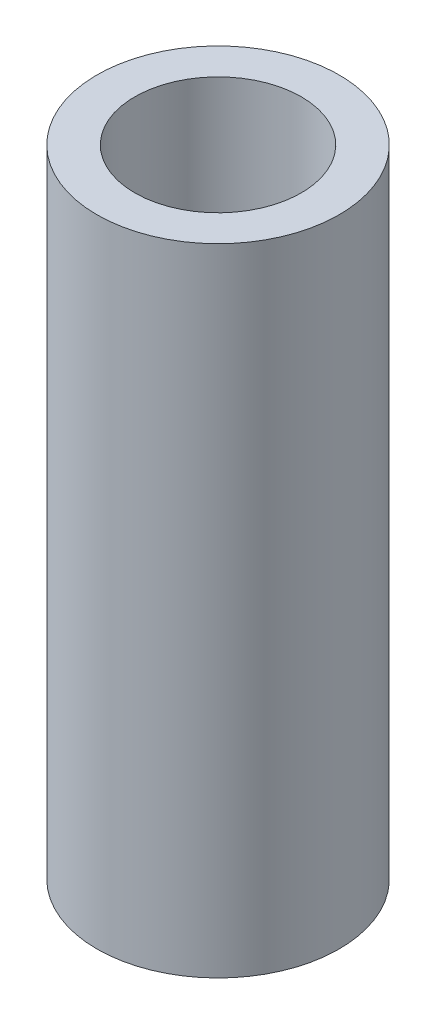
ISO-10303-21;
HEADER;
FILE_DESCRIPTION(('STEP AP214'),'2;1');
FILE_NAME('part.step','',(''),(''),'','','');
FILE_SCHEMA(('AUTOMOTIVE_DESIGN { 1 0 10303 214 1 1 1 1 }'));
ENDSEC;
DATA;
#1=APPLICATION_CONTEXT('core data for automotive mechanical design processes');
#2=APPLICATION_PROTOCOL_DEFINITION('international standard','automotive_design',2000,#1);
#3=PRODUCT_CONTEXT('',#1,'mechanical');
#4=PRODUCT('Part','Part','',(#3));
#5=PRODUCT_RELATED_PRODUCT_CATEGORY('part','',(#4));
#6=PRODUCT_DEFINITION_FORMATION('','',#4);
#7=PRODUCT_DEFINITION_CONTEXT('part definition',#1,'design');
#8=PRODUCT_DEFINITION('design','',#6,#7);
#9=PRODUCT_DEFINITION_SHAPE('','',#8);
#10=(LENGTH_UNIT() NAMED_UNIT(*) SI_UNIT(.MILLI.,.METRE.));
#11=(NAMED_UNIT(*) PLANE_ANGLE_UNIT() SI_UNIT($,.RADIAN.));
#12=(NAMED_UNIT(*) SI_UNIT($,.STERADIAN.) SOLID_ANGLE_UNIT());
#13=UNCERTAINTY_MEASURE_WITH_UNIT(LENGTH_MEASURE(1.E-05),#10,'distance_accuracy_value','');
#14=(GEOMETRIC_REPRESENTATION_CONTEXT(3) GLOBAL_UNCERTAINTY_ASSIGNED_CONTEXT((#13)) GLOBAL_UNIT_ASSIGNED_CONTEXT((#10,
#11,#12)) REPRESENTATION_CONTEXT('',''));
#15=CARTESIAN_POINT('',(0.,0.,0.));
#16=DIRECTION('',(0.,0.,1.));
#17=DIRECTION('',(1.,0.,0.));
#18=AXIS2_PLACEMENT_3D('',#15,#16,#17);
#19=CARTESIAN_POINT('',(0.,21.,0.));
#20=DIRECTION('',(0.,-1.,0.));
#21=DIRECTION('',(0.,0.,-1.));
#22=AXIS2_PLACEMENT_3D('',#19,#20,#21);
#23=CYLINDRICAL_SURFACE('',#22,4.);
#24=DIRECTION('',(0.,-1.,0.));
#25=VECTOR('',#24,1.);
#26=CARTESIAN_POINT('',(-3.99991645107305,21.,-0.0258531320189111));
#27=LINE('',#26,#25);
#28=CARTESIAN_POINT('',(-3.99991645107308,17.399761270919,-0.025853132018911));
#29=VERTEX_POINT('',#28);
#30=CARTESIAN_POINT('',(-3.99991645107308,14.600238729081,-0.025853132018911));
#31=VERTEX_POINT('',#30);
#32=EDGE_CURVE('E11',#29,#31,#27,.T.);
#33=ORIENTED_EDGE('',*,*,#32,.T.);
#34=CARTESIAN_POINT('',(-3.99991645107308,14.600238729081,-0.0258531320190421));
#35=CARTESIAN_POINT('',(-3.99967225830139,14.6009439988238,-0.0640921575293315));
#36=CARTESIAN_POINT('',(-3.99887347610365,14.6032187619792,-0.102278964228953));
#37=CARTESIAN_POINT('',(-3.99620499133585,14.6108738995903,-0.178292419562263));
#38=CARTESIAN_POINT('',(-3.99433556857381,14.6162534626206,-0.216119159673172));
#39=CARTESIAN_POINT('',(-3.98719610185074,14.6369488008378,-0.328422064505284));
#40=CARTESIAN_POINT('',(-3.98039240823535,14.6568271415164,-0.402013757078062));
#41=CARTESIAN_POINT('',(-3.96340813940453,14.7080320373958,-0.544576356502268));
#42=CARTESIAN_POINT('',(-3.95322930854667,14.7393526797706,-0.613549628185836));
#43=CARTESIAN_POINT('',(-3.93052020660311,14.8124834378182,-0.745307835813629));
#44=CARTESIAN_POINT('',(-3.91798857048058,14.8542996475161,-0.808089146927107));
#45=CARTESIAN_POINT('',(-3.89135352945277,14.9489240346771,-0.928050448785724));
#46=CARTESIAN_POINT('',(-3.8772106603566,15.0020634331421,-0.984960294435631));
#47=CARTESIAN_POINT('',(-3.84921378824501,15.1170764566808,-1.08925407411135));
#48=CARTESIAN_POINT('',(-3.83535986056662,15.1789523277724,-1.1366355509169));
#49=CARTESIAN_POINT('',(-3.80908699514521,15.3118854332206,-1.22184578759158));
#50=CARTESIAN_POINT('',(-3.79672101385227,15.3831561146456,-1.2593593716383));
#51=CARTESIAN_POINT('',(-3.77546131742445,15.5315120212514,-1.32173627746362));
#52=CARTESIAN_POINT('',(-3.76656616175619,15.6085948182841,-1.34660484873724));
#53=CARTESIAN_POINT('',(-3.75372261689463,15.7631109656046,-1.38199497149599));
#54=CARTESIAN_POINT('',(-3.74958979642407,15.840405738016,-1.39305292756278));
#55=CARTESIAN_POINT('',(-3.74619639341714,15.9958548095515,-1.40215536416123));
#56=CARTESIAN_POINT('',(-3.74693437342952,16.0740088482956,-1.40020368404321));
#57=CARTESIAN_POINT('',(-3.75302260858192,16.2249354068714,-1.38379454669174));
#58=CARTESIAN_POINT('',(-3.75814713768332,16.2977849538027,-1.36994900946075));
#59=CARTESIAN_POINT('',(-3.77208656020989,16.440062954669,-1.33108421220736));
#60=CARTESIAN_POINT('',(-3.78090196998585,16.5094909284095,-1.30606338874007));
#61=CARTESIAN_POINT('',(-3.8014547569224,16.6446909983725,-1.24498869082329));
#62=CARTESIAN_POINT('',(-3.81325163509311,16.7103504237503,-1.20870621983939));
#63=CARTESIAN_POINT('',(-3.83839332211351,16.8348584792766,-1.12631614578102));
#64=CARTESIAN_POINT('',(-3.85173858055954,16.8937051212682,-1.08020568572731));
#65=CARTESIAN_POINT('',(-3.87940616234065,17.0064550711861,-0.976347097309243));
#66=CARTESIAN_POINT('',(-3.89374063509772,17.0598814916565,-0.918083294265943));
#67=CARTESIAN_POINT('',(-3.92108981098457,17.156325832214,-0.79318088663264));
#68=CARTESIAN_POINT('',(-3.93410407430078,17.1993402902396,-0.726539507591292));
#69=CARTESIAN_POINT('',(-3.95748807810665,17.2739625280279,-0.586005200561402));
#70=CARTESIAN_POINT('',(-3.96783560070064,17.3054753314649,-0.51205802975848));
#71=CARTESIAN_POINT('',(-3.98454566226436,17.3554207033291,-0.359510885329969));
#72=CARTESIAN_POINT('',(-3.99091545014645,17.3738770736394,-0.280919662805801));
#73=CARTESIAN_POINT('',(-3.9963966045933,17.3896748938166,-0.172255891920458));
#74=CARTESIAN_POINT('',(-3.99754872485567,17.3929825667261,-0.143056897965824));
#75=CARTESIAN_POINT('',(-3.99921326658427,17.39775252398,-0.0845341011151192));
#76=CARTESIAN_POINT('',(-3.99972663497742,17.3992175400328,-0.0552105477894228));
#77=CARTESIAN_POINT('',(-3.99991645107305,17.399761270919,-0.0258531320190412));
#78=B_SPLINE_CURVE_WITH_KNOTS('',3,(#34,#35,#36,#37,#38,#39,#40,#41,#42,#43,#44,#45,#46,#47,#48,
#49,#50,#51,#52,#53,#54,#55,#56,#57,#58,#59,#60,#61,#62,#63,#64,#65,#66,#67,#68,#69,#70,#71,#72,
#73,#74,#75,#76,#77),.UNSPECIFIED.,.F.,.F.,(4,2,2,2,2,2,2,2,2,2,2,2,2,2,2,2,2,2,2,2,2,4),(0.,
0.114664507603254,0.229299061720669,0.457701131164789,0.685985340068443,0.9144024051538,
1.15074978367751,1.38715803462588,1.63038942015454,1.87351974714062,2.1068793264695,
2.34017004072909,2.56213147320374,2.78412396825833,3.01095516106762,3.23785238346189,
3.47775904339029,3.71774536497249,3.9596708177997,4.20115409590331,4.28932861164633,
4.37737225545862),.UNSPECIFIED.);
#79=EDGE_CURVE('E87',#31,#29,#78,.T.);
#80=ORIENTED_EDGE('',*,*,#79,.T.);
#81=EDGE_LOOP('',(#33,#80));
#82=FACE_BOUND('',#81,.T.);
#83=DIRECTION('',(0.,-1.,0.));
#84=VECTOR('',#83,1.);
#85=CARTESIAN_POINT('',(-3.99991645107305,21.,0.0258531320189111));
#86=LINE('',#85,#84);
#87=CARTESIAN_POINT('',(-3.99991645107308,14.600238729081,0.025853132018911));
#88=VERTEX_POINT('',#87);
#89=CARTESIAN_POINT('',(-3.99991645107308,17.399761270919,0.025853132018911));
#90=VERTEX_POINT('',#89);
#91=EDGE_CURVE('E48',#88,#90,#86,.F.);
#92=ORIENTED_EDGE('',*,*,#91,.T.);
#93=CARTESIAN_POINT('',(-3.99991645107308,17.399761270919,0.0258531320190421));
#94=CARTESIAN_POINT('',(-3.99967225830139,17.3990560011763,0.0640921575293312));
#95=CARTESIAN_POINT('',(-3.99887347610365,17.3967812380208,0.102278964228953));
#96=CARTESIAN_POINT('',(-3.99620499133585,17.3891261004098,0.178292419562263));
#97=CARTESIAN_POINT('',(-3.99433556857381,17.3837465373795,0.216119159673172));
#98=CARTESIAN_POINT('',(-3.98719610185074,17.3630511991623,0.328422064505283));
#99=CARTESIAN_POINT('',(-3.98039240823535,17.3431728584837,0.40201375707806));
#100=CARTESIAN_POINT('',(-3.96340813940453,17.2919679626042,0.544576356502268));
#101=CARTESIAN_POINT('',(-3.95322930854667,17.2606473202295,0.613549628185838));
#102=CARTESIAN_POINT('',(-3.93052020660311,17.1875165621819,0.74530783581363));
#103=CARTESIAN_POINT('',(-3.91798857048058,17.145700352484,0.808089146927105));
#104=CARTESIAN_POINT('',(-3.89135352945277,17.051075965323,0.928050448785722));
#105=CARTESIAN_POINT('',(-3.8772106603566,16.997936566858,0.98496029443563));
#106=CARTESIAN_POINT('',(-3.84921378824501,16.8829235433193,1.08925407411135));
#107=CARTESIAN_POINT('',(-3.83535986056663,16.8210476722277,1.13663555091689));
#108=CARTESIAN_POINT('',(-3.80908699514521,16.6881145667794,1.22184578759158));
#109=CARTESIAN_POINT('',(-3.79672101385227,16.6168438853544,1.25935937163829));
#110=CARTESIAN_POINT('',(-3.77546131742445,16.4684879787486,1.32173627746362));
#111=CARTESIAN_POINT('',(-3.76656616175619,16.391405181716,1.34660484873724));
#112=CARTESIAN_POINT('',(-3.75372261689463,16.2368890343955,1.38199497149599));
#113=CARTESIAN_POINT('',(-3.74958979642407,16.1595942619841,1.39305292756278));
#114=CARTESIAN_POINT('',(-3.74619639341714,16.0041451904485,1.40215536416123));
#115=CARTESIAN_POINT('',(-3.74693437342952,15.9259911517045,1.40020368404321));
#116=CARTESIAN_POINT('',(-3.75302260858192,15.7750645931286,1.38379454669174));
#117=CARTESIAN_POINT('',(-3.75814713768331,15.7022150461974,1.36994900946075));
#118=CARTESIAN_POINT('',(-3.77208656020989,15.5599370453311,1.33108421220736));
#119=CARTESIAN_POINT('',(-3.78090196998585,15.4905090715906,1.30606338874007));
#120=CARTESIAN_POINT('',(-3.8014547569224,15.3553090016275,1.24498869082329));
#121=CARTESIAN_POINT('',(-3.81325163509311,15.2896495762497,1.20870621983939));
#122=CARTESIAN_POINT('',(-3.83839332211351,15.1651415207234,1.12631614578102));
#123=CARTESIAN_POINT('',(-3.85173858055954,15.1062948787318,1.0802056857273));
#124=CARTESIAN_POINT('',(-3.87940616234065,14.993544928814,0.976347097309244));
#125=CARTESIAN_POINT('',(-3.89374063509773,14.9401185083435,0.918083294265944));
#126=CARTESIAN_POINT('',(-3.92108981098458,14.8436741677861,0.79318088663264));
#127=CARTESIAN_POINT('',(-3.93410407430078,14.8006597097605,0.726539507591293));
#128=CARTESIAN_POINT('',(-3.95748807810665,14.7260374719722,0.586005200561404));
#129=CARTESIAN_POINT('',(-3.96783560070064,14.6945246685351,0.512058029758483));
#130=CARTESIAN_POINT('',(-3.98454566226436,14.644579296671,0.359510885329972));
#131=CARTESIAN_POINT('',(-3.99091545014645,14.6261229263606,0.280919662805803));
#132=CARTESIAN_POINT('',(-3.9963966045933,14.6103251061834,0.17225589192046));
#133=CARTESIAN_POINT('',(-3.99754872485567,14.607017433274,0.143056897965826));
#134=CARTESIAN_POINT('',(-3.99921326658427,14.6022474760201,0.0845341011151206));
#135=CARTESIAN_POINT('',(-3.99972663497742,14.6007824599673,0.0552105477894235));
#136=CARTESIAN_POINT('',(-3.99991645107305,14.600238729081,0.0258531320190412));
#137=B_SPLINE_CURVE_WITH_KNOTS('',3,(#93,#94,#95,#96,#97,#98,#99,#100,#101,#102,#103,#104,#105,
#106,#107,#108,#109,#110,#111,#112,#113,#114,#115,#116,#117,#118,#119,#120,#121,#122,#123,#124,
#125,#126,#127,#128,#129,#130,#131,#132,#133,#134,#135,#136),.UNSPECIFIED.,.F.,.F.,(4,2,2,2,2,2,
2,2,2,2,2,2,2,2,2,2,2,2,2,2,2,4),(0.,0.114664507603254,0.229299061720668,0.457701131164788,
0.685985340068446,0.914402405153799,1.15074978367751,1.38715803462588,1.63038942015453,
1.87351974714062,2.1068793264695,2.34017004072909,2.56213147320374,2.78412396825833,
3.01095516106763,3.23785238346189,3.4777590433903,3.71774536497248,3.95967081779969,
4.20115409590331,4.28932861164633,4.37737225545862),.UNSPECIFIED.);
#138=EDGE_CURVE('E85',#90,#88,#137,.T.);
#139=ORIENTED_EDGE('',*,*,#138,.T.);
#140=EDGE_LOOP('',(#92,#139));
#141=FACE_BOUND('',#140,.T.);
#142=DIRECTION('',(0.,-1.,0.));
#143=VECTOR('',#142,1.);
#144=CARTESIAN_POINT('',(-3.99991645107305,21.,-0.0258531320189111));
#145=LINE('',#144,#143);
#146=CARTESIAN_POINT('',(-3.99991645107316,6.39976127091904,-0.025853132018911));
#147=VERTEX_POINT('',#146);
#148=CARTESIAN_POINT('',(-3.99991645107316,3.60023872908101,-0.025853132018911));
#149=VERTEX_POINT('',#148);
#150=EDGE_CURVE('E82',#147,#149,#145,.T.);
#151=ORIENTED_EDGE('',*,*,#150,.T.);
#152=CARTESIAN_POINT('',(-3.99991645107316,3.60023872908101,-0.0258531320189111));
#153=CARTESIAN_POINT('',(-3.99967225830142,3.60094399882377,-0.0640921575291983));
#154=CARTESIAN_POINT('',(-3.99887347610366,3.6032187619792,-0.102278964228819));
#155=CARTESIAN_POINT('',(-3.99620499133584,3.61087389959025,-0.178292419562128));
#156=CARTESIAN_POINT('',(-3.99433556857381,3.61625346262055,-0.216119159673037));
#157=CARTESIAN_POINT('',(-3.98719610185076,3.63694880083776,-0.328422064505149));
#158=CARTESIAN_POINT('',(-3.98039240823537,3.65682714151634,-0.402013757077929));
#159=CARTESIAN_POINT('',(-3.96340813940455,3.70803203739579,-0.544576356502139));
#160=CARTESIAN_POINT('',(-3.95322930854669,3.73935267977053,-0.61354962818571));
#161=CARTESIAN_POINT('',(-3.93052020660313,3.81248343781812,-0.745307835813509));
#162=CARTESIAN_POINT('',(-3.91798857048061,3.854299647516,-0.808089146926989));
#163=CARTESIAN_POINT('',(-3.8913535294528,3.94892403467695,-0.928050448785614));
#164=CARTESIAN_POINT('',(-3.87721066035663,4.00206343314195,-0.984960294435526));
#165=CARTESIAN_POINT('',(-3.84921378824504,4.11707645668067,-1.08925407411126));
#166=CARTESIAN_POINT('',(-3.83535986056665,4.17895232777225,-1.13663555091681));
#167=CARTESIAN_POINT('',(-3.80908699514523,4.31188543322051,-1.2218457875915));
#168=CARTESIAN_POINT('',(-3.79672101385229,4.38315611464547,-1.25935937163823));
#169=CARTESIAN_POINT('',(-3.77546131742447,4.53151202125127,-1.32173627746357));
#170=CARTESIAN_POINT('',(-3.76656616175621,4.60859481828395,-1.3466048487372));
#171=CARTESIAN_POINT('',(-3.75372261689464,4.76311096560443,-1.38199497149597));
#172=CARTESIAN_POINT('',(-3.74958979642408,4.84040573801585,-1.39305292756276));
#173=CARTESIAN_POINT('',(-3.74619639341714,4.99585480955136,-1.40215536416123));
#174=CARTESIAN_POINT('',(-3.74693437342952,5.07400884829543,-1.40020368404322));
#175=CARTESIAN_POINT('',(-3.75302260858191,5.22493540687129,-1.38379454669176));
#176=CARTESIAN_POINT('',(-3.7581471376833,5.29778495380255,-1.36994900946078));
#177=CARTESIAN_POINT('',(-3.77208656020987,5.44006295466883,-1.33108421220741));
#178=CARTESIAN_POINT('',(-3.78090196998583,5.50949092840937,-1.30606338874012));
#179=CARTESIAN_POINT('',(-3.80145475692238,5.6446909983724,-1.24498869082335));
#180=CARTESIAN_POINT('',(-3.81325163509309,5.71035042375019,-1.20870621983946));
#181=CARTESIAN_POINT('',(-3.83839332211348,5.83485847927652,-1.12631614578111));
#182=CARTESIAN_POINT('',(-3.85173858055951,5.8937051212681,-1.0802056857274));
#183=CARTESIAN_POINT('',(-3.87940616234062,6.00645507118598,-0.976347097309352));
#184=CARTESIAN_POINT('',(-3.8937406350977,6.05988149165643,-0.918083294266058));
#185=CARTESIAN_POINT('',(-3.92108981098455,6.15632583221387,-0.793180886632766));
#186=CARTESIAN_POINT('',(-3.93410407430075,6.19934029023948,-0.726539507591425));
#187=CARTESIAN_POINT('',(-3.95748807810663,6.27396252802781,-0.586005200561544));
#188=CARTESIAN_POINT('',(-3.96783560070062,6.30547533146489,-0.512058029758626));
#189=CARTESIAN_POINT('',(-3.98454566226434,6.35542070332904,-0.359510885330119));
#190=CARTESIAN_POINT('',(-3.99091545014644,6.37387707363939,-0.280919662805951));
#191=CARTESIAN_POINT('',(-3.9963966045933,6.3896748938166,-0.172255891920562));
#192=CARTESIAN_POINT('',(-3.99754872485567,6.3929825667261,-0.14305689796588));
#193=CARTESIAN_POINT('',(-3.99921326658427,6.39775252397999,-0.0845341011150808));
#194=CARTESIAN_POINT('',(-3.99972663497742,6.39921754003277,-0.0552105477893363));
#195=CARTESIAN_POINT('',(-3.99991645107305,6.39976127091905,-0.0258531320189066));
#196=B_SPLINE_CURVE_WITH_KNOTS('',3,(#152,#153,#154,#155,#156,#157,#158,#159,#160,#161,#162,
#163,#164,#165,#166,#167,#168,#169,#170,#171,#172,#173,#174,#175,#176,#177,#178,#179,#180,#181,
#182,#183,#184,#185,#186,#187,#188,#189,#190,#191,#192,#193,#194,#195),.UNSPECIFIED.,.F.,.F.,(4,
2,2,2,2,2,2,2,2,2,2,2,2,2,2,2,2,2,2,2,2,4),(0.,0.114664507603251,0.229299061720663,
0.457701131164782,0.685985340068434,0.914402405153786,1.15074978367749,1.38715803462586,
1.63038942015451,1.8735197471406,2.10687932646949,2.34017004072907,2.56213147320373,
2.78412396825832,3.01095516106761,3.23785238346187,3.47775904339027,3.71774536497246,
3.95967081779967,4.20115409590329,4.28932861164646,4.37737225545889),.UNSPECIFIED.);
#197=EDGE_CURVE('E177',#149,#147,#196,.T.);
#198=ORIENTED_EDGE('',*,*,#197,.T.);
#199=EDGE_LOOP('',(#151,#198));
#200=FACE_BOUND('',#199,.T.);
#201=DIRECTION('',(0.,-1.,0.));
#202=VECTOR('',#201,1.);
#203=CARTESIAN_POINT('',(-3.99991645107305,21.,0.0258531320189111));
#204=LINE('',#203,#202);
#205=CARTESIAN_POINT('',(-3.99991645107316,3.60023872908101,0.025853132018911));
#206=VERTEX_POINT('',#205);
#207=CARTESIAN_POINT('',(-3.99991645107316,6.39976127091904,0.025853132018911));
#208=VERTEX_POINT('',#207);
#209=EDGE_CURVE('E182',#206,#208,#204,.F.);
#210=ORIENTED_EDGE('',*,*,#209,.T.);
#211=CARTESIAN_POINT('',(-3.99991645107316,6.39976127091904,0.0258531320189111));
#212=CARTESIAN_POINT('',(-3.99967225830142,6.39905600117628,0.0640921575291982));
#213=CARTESIAN_POINT('',(-3.99887347610366,6.39678123802085,0.102278964228819));
#214=CARTESIAN_POINT('',(-3.99620499133584,6.38912610040981,0.178292419562127));
#215=CARTESIAN_POINT('',(-3.99433556857381,6.38374653737951,0.216119159673036));
#216=CARTESIAN_POINT('',(-3.98719610185076,6.3630511991623,0.328422064505149));
#217=CARTESIAN_POINT('',(-3.98039240823537,6.34317285848372,0.402013757077927));
#218=CARTESIAN_POINT('',(-3.96340813940455,6.29196796260427,0.544576356502137));
#219=CARTESIAN_POINT('',(-3.95322930854669,6.26064732022953,0.613549628185708));
#220=CARTESIAN_POINT('',(-3.93052020660313,6.18751656218193,0.745307835813506));
#221=CARTESIAN_POINT('',(-3.9179885704806,6.14570035248406,0.808089146926986));
#222=CARTESIAN_POINT('',(-3.8913535294528,6.0510759653231,0.928050448785611));
#223=CARTESIAN_POINT('',(-3.87721066035663,5.99793656685811,0.984960294435523));
#224=CARTESIAN_POINT('',(-3.84921378824504,5.88292354331939,1.08925407411126));
#225=CARTESIAN_POINT('',(-3.83535986056665,5.82104767222781,1.1366355509168));
#226=CARTESIAN_POINT('',(-3.80908699514524,5.68811456677954,1.2218457875915));
#227=CARTESIAN_POINT('',(-3.79672101385229,5.61684388535459,1.25935937163823));
#228=CARTESIAN_POINT('',(-3.77546131742447,5.46848797874879,1.32173627746357));
#229=CARTESIAN_POINT('',(-3.76656616175621,5.39140518171611,1.3466048487372));
#230=CARTESIAN_POINT('',(-3.75372261689464,5.23688903439562,1.38199497149597));
#231=CARTESIAN_POINT('',(-3.74958979642408,5.1595942619842,1.39305292756276));
#232=CARTESIAN_POINT('',(-3.74619639341714,5.00414519044869,1.40215536416123));
#233=CARTESIAN_POINT('',(-3.74693437342952,4.92599115170463,1.40020368404322));
#234=CARTESIAN_POINT('',(-3.75302260858191,4.77506459312876,1.38379454669176));
#235=CARTESIAN_POINT('',(-3.7581471376833,4.70221504619751,1.36994900946078));
#236=CARTESIAN_POINT('',(-3.77208656020987,4.55993704533122,1.33108421220741));
#237=CARTESIAN_POINT('',(-3.78090196998583,4.49050907159068,1.30606338874012));
#238=CARTESIAN_POINT('',(-3.80145475692238,4.35530900162765,1.24498869082335));
#239=CARTESIAN_POINT('',(-3.81325163509309,4.28964957624987,1.20870621983946));
#240=CARTESIAN_POINT('',(-3.83839332211348,4.16514152072353,1.12631614578111));
#241=CARTESIAN_POINT('',(-3.85173858055951,4.10629487873195,1.0802056857274));
#242=CARTESIAN_POINT('',(-3.87940616234062,3.99354492881407,0.976347097309353));
#243=CARTESIAN_POINT('',(-3.8937406350977,3.94011850834362,0.918083294266059));
#244=CARTESIAN_POINT('',(-3.92108981098455,3.84367416778618,0.793180886632768));
#245=CARTESIAN_POINT('',(-3.93410407430075,3.80065970976057,0.726539507591427));
#246=CARTESIAN_POINT('',(-3.95748807810663,3.72603747197224,0.586005200561547));
#247=CARTESIAN_POINT('',(-3.96783560070062,3.69452466853517,0.512058029758628));
#248=CARTESIAN_POINT('',(-3.98454566226434,3.64457929667102,0.359510885330122));
#249=CARTESIAN_POINT('',(-3.99091545014644,3.62612292636067,0.280919662805955));
#250=CARTESIAN_POINT('',(-3.9963966045933,3.61032510618346,0.172255891920565));
#251=CARTESIAN_POINT('',(-3.99754872485567,3.60701743327396,0.143056897965883));
#252=CARTESIAN_POINT('',(-3.99921326658427,3.60224747602007,0.0845341011150814));
#253=CARTESIAN_POINT('',(-3.99972663497742,3.60078245996728,0.0552105477893365));
#254=CARTESIAN_POINT('',(-3.99991645107305,3.60023872908101,0.0258531320189065));
#255=B_SPLINE_CURVE_WITH_KNOTS('',3,(#211,#212,#213,#214,#215,#216,#217,#218,#219,#220,#221,
#222,#223,#224,#225,#226,#227,#228,#229,#230,#231,#232,#233,#234,#235,#236,#237,#238,#239,#240,
#241,#242,#243,#244,#245,#246,#247,#248,#249,#250,#251,#252,#253,#254),.UNSPECIFIED.,.F.,.F.,(4,
2,2,2,2,2,2,2,2,2,2,2,2,2,2,2,2,2,2,2,2,4),(0.,0.114664507603251,0.229299061720663,
0.457701131164781,0.685985340068431,0.914402405153782,1.15074978367749,1.38715803462585,
1.63038942015451,1.8735197471406,2.10687932646949,2.34017004072907,2.56213147320373,
2.78412396825832,3.01095516106761,3.23785238346187,3.47775904339027,3.71774536497246,
3.95967081779967,4.20115409590329,4.28932861164646,4.37737225545889),.UNSPECIFIED.);
#256=EDGE_CURVE('E174',#208,#206,#255,.T.);
#257=ORIENTED_EDGE('',*,*,#256,.T.);
#258=EDGE_LOOP('',(#210,#257));
#259=FACE_BOUND('',#258,.T.);
#260=CARTESIAN_POINT('',(0.,21.,0.));
#261=DIRECTION('',(0.,1.,0.));
#262=DIRECTION('',(0.,0.,1.));
#263=AXIS2_PLACEMENT_3D('',#260,#261,#262);
#264=CIRCLE('',#263,4.);
#265=CARTESIAN_POINT('',(0.,21.,4.));
#266=VERTEX_POINT('',#265);
#267=EDGE_CURVE('E222',#266,#266,#264,.T.);
#268=ORIENTED_EDGE('',*,*,#267,.F.);
#269=EDGE_LOOP('',(#268));
#270=FACE_BOUND('',#269,.T.);
#271=CARTESIAN_POINT('',(0.,0.,0.));
#272=DIRECTION('',(0.,1.,0.));
#273=DIRECTION('',(0.,0.,1.));
#274=AXIS2_PLACEMENT_3D('',#271,#272,#273);
#275=CIRCLE('',#274,4.);
#276=CARTESIAN_POINT('',(0.,0.,4.));
#277=VERTEX_POINT('',#276);
#278=EDGE_CURVE('E128',#277,#277,#275,.T.);
#279=ORIENTED_EDGE('',*,*,#278,.T.);
#280=EDGE_LOOP('',(#279));
#281=FACE_BOUND('',#280,.T.);
#282=ADVANCED_FACE('F39',(#82,#141,#200,#259,#270,#281),#23,.T.);
#283=CARTESIAN_POINT('',(0.,21.,0.));
#284=DIRECTION('',(0.,1.,0.));
#285=DIRECTION('',(0.,0.,1.));
#286=AXIS2_PLACEMENT_3D('',#283,#284,#285);
#287=PLANE('',#286);
#288=CARTESIAN_POINT('',(0.,21.,0.));
#289=DIRECTION('',(0.,1.,0.));
#290=DIRECTION('',(0.,0.,1.));
#291=AXIS2_PLACEMENT_3D('',#288,#289,#290);
#292=CIRCLE('',#291,2.75);
#293=CARTESIAN_POINT('',(0.,21.,2.75));
#294=VERTEX_POINT('',#293);
#295=EDGE_CURVE('E186',#294,#294,#292,.T.);
#296=ORIENTED_EDGE('',*,*,#295,.F.);
#297=EDGE_LOOP('',(#296));
#298=FACE_BOUND('',#297,.T.);
#299=ORIENTED_EDGE('',*,*,#267,.T.);
#300=EDGE_LOOP('',(#299));
#301=FACE_BOUND('',#300,.T.);
#302=ADVANCED_FACE('F151',(#298,#301),#287,.T.);
#303=CARTESIAN_POINT('',(0.,0.,0.));
#304=DIRECTION('',(0.,1.,0.));
#305=DIRECTION('',(0.,0.,1.));
#306=AXIS2_PLACEMENT_3D('',#303,#304,#305);
#307=PLANE('',#306);
#308=CARTESIAN_POINT('',(0.,0.,0.));
#309=DIRECTION('',(0.,-1.,0.));
#310=DIRECTION('',(0.,0.,-1.));
#311=AXIS2_PLACEMENT_3D('',#308,#309,#310);
#312=CIRCLE('',#311,3.2);
#313=CARTESIAN_POINT('',(0.,0.,-3.2));
#314=VERTEX_POINT('',#313);
#315=EDGE_CURVE('E213',#314,#314,#312,.T.);
#316=ORIENTED_EDGE('',*,*,#315,.F.);
#317=EDGE_LOOP('',(#316));
#318=FACE_BOUND('',#317,.T.);
#319=ORIENTED_EDGE('',*,*,#278,.F.);
#320=EDGE_LOOP('',(#319));
#321=FACE_BOUND('',#320,.T.);
#322=ADVANCED_FACE('F149',(#318,#321),#307,.F.);
#323=CARTESIAN_POINT('',(0.,10.,0.));
#324=DIRECTION('',(0.,-1.,0.));
#325=DIRECTION('',(0.,0.,-1.));
#326=AXIS2_PLACEMENT_3D('',#323,#324,#325);
#327=CYLINDRICAL_SURFACE('',#326,3.2);
#328=CARTESIAN_POINT('',(-3.2,3.60000000000002,0.));
#329=CARTESIAN_POINT('',(-3.19999323929896,3.60000882862046,0.0746682325298775));
#330=CARTESIAN_POINT('',(-3.19735695673799,3.60600835816502,0.149436290609146));
#331=CARTESIAN_POINT('',(-3.18706462250722,3.62978490809575,0.296838561834425));
#332=CARTESIAN_POINT('',(-3.17939623551487,3.64759087100718,0.369467071934258));
#333=CARTESIAN_POINT('',(-3.15985979638772,3.69418283092299,0.510210727685957));
#334=CARTESIAN_POINT('',(-3.14800655397558,3.72293013541371,0.57834079637958));
#335=CARTESIAN_POINT('',(-3.12123780515295,3.79042054568872,0.708739295318285));
#336=CARTESIAN_POINT('',(-3.10632305462494,3.82916118473621,0.7710091669143));
#337=CARTESIAN_POINT('',(-3.07400114777708,3.91774957634818,0.891399307299581));
#338=CARTESIAN_POINT('',(-3.05650709697098,3.96805267426737,0.949160930428645));
#339=CARTESIAN_POINT('',(-3.02135131890907,4.07737245601193,1.05574232998401));
#340=CARTESIAN_POINT('',(-3.00368950092187,4.13639413946651,1.10455693955992));
#341=CARTESIAN_POINT('',(-2.9690927777526,4.26543856539599,1.19454701616179));
#342=CARTESIAN_POINT('',(-2.95225267260003,4.33589015374362,1.23514788937881));
#343=CARTESIAN_POINT('',(-2.92260314752168,4.48346132572815,1.30376311363399));
#344=CARTESIAN_POINT('',(-2.9097914452503,4.56057710199087,1.3317845955581));
#345=CARTESIAN_POINT('',(-2.89059965408317,4.71516169742201,1.37292682646117));
#346=CARTESIAN_POINT('',(-2.88392212034105,4.79240748537646,1.38674110526249));
#347=CARTESIAN_POINT('',(-2.87691007594234,4.94838677799436,1.40123529298112));
#348=CARTESIAN_POINT('',(-2.87657152755454,5.02711930365459,1.40192356275211));
#349=CARTESIAN_POINT('',(-2.88202665013976,5.17658359891195,1.39066469697343));
#350=CARTESIAN_POINT('',(-2.88729445733953,5.24742021626037,1.37980117002711));
#351=CARTESIAN_POINT('',(-2.90247226483301,5.38614010882635,1.34757876598954));
#352=CARTESIAN_POINT('',(-2.91238326673219,5.45402274337172,1.32621762435952));
#353=CARTESIAN_POINT('',(-2.93595952759738,5.58670579267017,1.2731835971743));
#354=CARTESIAN_POINT('',(-2.94970322228104,5.65140437146944,1.24129238704281));
#355=CARTESIAN_POINT('',(-2.97938258432282,5.77479985933511,1.16825974889634));
#356=CARTESIAN_POINT('',(-2.99531916026687,5.83349426299944,1.12711448210096));
#357=CARTESIAN_POINT('',(-3.02940997516427,5.94902819970128,1.03220450369383));
#358=CARTESIAN_POINT('',(-3.04763179448214,6.00517368661696,0.977616720899959));
#359=CARTESIAN_POINT('',(-3.08298711786831,6.10775987826215,0.859639861912725));
#360=CARTESIAN_POINT('',(-3.10012031174763,6.15419782551534,0.796248293446521));
#361=CARTESIAN_POINT('',(-3.13196210037405,6.23721440381238,0.66016925228355));
#362=CARTESIAN_POINT('',(-3.14659001099467,6.2734829128974,0.587272278263271));
#363=CARTESIAN_POINT('',(-3.17114037284155,6.33299309785246,0.435607390856095));
#364=CARTESIAN_POINT('',(-3.18106569682268,6.35624272838524,0.356843095870493));
#365=CARTESIAN_POINT('',(-3.1945388332546,6.38753830009636,0.201455047470969));
#366=CARTESIAN_POINT('',(-3.19847581943999,6.39651393340044,0.125052333509547));
#367=CARTESIAN_POINT('',(-3.2007922664932,6.40181271555229,-0.0282640651341215));
#368=CARTESIAN_POINT('',(-3.19917353770823,6.39813998590759,-0.10517757521984));
#369=CARTESIAN_POINT('',(-3.19080873687224,6.37888616161881,-0.252793729037831));
#370=CARTESIAN_POINT('',(-3.18435437244214,6.36398229289883,-0.323603206184578));
#371=CARTESIAN_POINT('',(-3.1672925050764,6.3236594347154,-0.461624114121053));
#372=CARTESIAN_POINT('',(-3.15668449196048,6.29823915353068,-0.52883510176584));
#373=CARTESIAN_POINT('',(-3.13190520783963,6.23678768417317,-0.660132529349556));
#374=CARTESIAN_POINT('',(-3.11763295400634,6.20044975949184,-0.724055715670428));
#375=CARTESIAN_POINT('',(-3.08701554400474,6.11852910687444,-0.845127836893712));
#376=CARTESIAN_POINT('',(-3.07066949286605,6.07294238239581,-0.902273826296681));
#377=CARTESIAN_POINT('',(-3.03606354570034,5.96965439698898,-1.0128843281988));
#378=CARTESIAN_POINT('',(-3.01775402187564,5.91128397486417,-1.06571002168735));
#379=CARTESIAN_POINT('',(-2.98238476439398,5.78626291589081,-1.16102178855706));
#380=CARTESIAN_POINT('',(-2.96532543173475,5.71960964064346,-1.20350455451119));
#381=CARTESIAN_POINT('',(-2.93414786375579,5.57799844717799,-1.27766771000143));
#382=CARTESIAN_POINT('',(-2.92009882997794,5.50289565303897,-1.30910280610461));
#383=CARTESIAN_POINT('',(-2.89741141326388,5.34764857374586,-1.35858805747395));
#384=CARTESIAN_POINT('',(-2.88876794930699,5.26750910109906,-1.37665078517921));
#385=CARTESIAN_POINT('',(-2.87870059545969,5.11161889436916,-1.39757122414597));
#386=CARTESIAN_POINT('',(-2.87673758203622,5.03605511942191,-1.40156534379494));
#387=CARTESIAN_POINT('',(-2.87879673024831,4.88536230259502,-1.39733172107155));
#388=CARTESIAN_POINT('',(-2.8828177181642,4.81023317836314,-1.38910637546167));
#389=CARTESIAN_POINT('',(-2.89587822994622,4.66694548881129,-1.36165261619709));
#390=CARTESIAN_POINT('',(-2.90462124077084,4.59863295391721,-1.34307241616426));
#391=CARTESIAN_POINT('',(-2.92587878716624,4.46609672226217,-1.29610727139735));
#392=CARTESIAN_POINT('',(-2.93839440474458,4.40187420495353,-1.26771951345155));
#393=CARTESIAN_POINT('',(-2.96676558143144,4.2748988493906,-1.19988864897201));
#394=CARTESIAN_POINT('',(-2.98278224731329,4.21249548508154,-1.1598601773472));
#395=CARTESIAN_POINT('',(-3.0159494898889,4.09493768917059,-1.0706593907491));
#396=CARTESIAN_POINT('',(-3.03310051918632,4.03978617755641,-1.02148341162247));
#397=CARTESIAN_POINT('',(-3.06832603234553,3.93353609988187,-0.910514271123461));
#398=CARTESIAN_POINT('',(-3.08635772876448,3.88316263349807,-0.848009730462911));
#399=CARTESIAN_POINT('',(-3.11990113043651,3.79355326264327,-0.714792550563451));
#400=CARTESIAN_POINT('',(-3.13541168934315,3.75432241863165,-0.644076202378754));
#401=CARTESIAN_POINT('',(-3.16200691540381,3.68882772121614,-0.497203699003514));
#402=CARTESIAN_POINT('',(-3.17314582493306,3.66240392533636,-0.42112899753792));
#403=CARTESIAN_POINT('',(-3.18995281447474,3.6230014036058,-0.265147894197037));
#404=CARTESIAN_POINT('',(-3.19563769617754,3.60998137696073,-0.18525406117933));
#405=CARTESIAN_POINT('',(-3.19942859954671,3.60130795436467,-0.0699772697921454));
#406=CARTESIAN_POINT('',(-3.20000316897606,3.59999586171811,-0.0349996013486818));
#407=CARTESIAN_POINT('',(-3.2,3.60000000000002,0.));
#408=B_SPLINE_CURVE_WITH_KNOTS('',3,(#328,#329,#330,#331,#332,#333,#334,#335,#336,#337,#338,
#339,#340,#341,#342,#343,#344,#345,#346,#347,#348,#349,#350,#351,#352,#353,#354,#355,#356,#357,
#358,#359,#360,#361,#362,#363,#364,#365,#366,#367,#368,#369,#370,#371,#372,#373,#374,#375,#376,
#377,#378,#379,#380,#381,#382,#383,#384,#385,#386,#387,#388,#389,#390,#391,#392,#393,#394,#395,
#396,#397,#398,#399,#400,#401,#402,#403,#404,#405,#406,#407),.UNSPECIFIED.,.T.,.F.,(4,2,2,2,2,2,
2,2,2,2,2,2,2,2,2,2,2,2,2,2,2,2,2,2,2,2,2,2,2,2,2,2,2,2,2,2,2,2,2,4),(0.,0.22389784388117,
0.448346594706908,0.672008880095001,0.895616009826726,1.1303060725882,1.36513124343025,
1.61299389023415,1.86071585303957,2.09567060708281,2.33047569735744,2.54504901527542,
2.75966864114528,2.97905125230743,3.19852503646187,3.43864747577074,3.67883803068161,
3.92570866035185,4.17242828458789,4.4023023507457,4.63210151882834,4.84905357520543,
5.06603228751983,5.28979086692528,5.5136463424347,5.7550333097822,5.99649736596454,
6.24302657717685,6.48932371106909,6.7152018646058,6.94103571957449,7.15410460735167,
7.3672346628778,7.59383609576229,7.82052849302986,8.06618640407504,8.3119557037418,
8.55457109012829,8.7964366520339,8.90138537002498),.UNSPECIFIED.);
#409=CARTESIAN_POINT('',(-3.2,3.60000000000002,0.));
#410=VERTEX_POINT('',#409);
#411=EDGE_CURVE('E97',#410,#410,#408,.T.);
#412=ORIENTED_EDGE('',*,*,#411,.T.);
#413=EDGE_LOOP('',(#412));
#414=FACE_BOUND('',#413,.T.);
#415=CARTESIAN_POINT('',(0.,10.,0.));
#416=DIRECTION('',(0.,-1.,0.));
#417=DIRECTION('',(0.,0.,-1.));
#418=AXIS2_PLACEMENT_3D('',#415,#416,#417);
#419=CIRCLE('',#418,3.2);
#420=CARTESIAN_POINT('',(0.,10.,-3.2));
#421=VERTEX_POINT('',#420);
#422=EDGE_CURVE('E211',#421,#421,#419,.T.);
#423=ORIENTED_EDGE('',*,*,#422,.F.);
#424=EDGE_LOOP('',(#423));
#425=FACE_BOUND('',#424,.T.);
#426=ORIENTED_EDGE('',*,*,#315,.T.);
#427=EDGE_LOOP('',(#426));
#428=FACE_BOUND('',#427,.T.);
#429=ADVANCED_FACE('F144',(#414,#425,#428),#327,.F.);
#430=CARTESIAN_POINT('',(0.,10.,0.));
#431=DIRECTION('',(0.,-1.,0.));
#432=DIRECTION('',(0.,0.,-1.));
#433=AXIS2_PLACEMENT_3D('',#430,#431,#432);
#434=PLANE('',#433);
#435=ORIENTED_EDGE('',*,*,#422,.T.);
#436=EDGE_LOOP('',(#435));
#437=FACE_BOUND('',#436,.T.);
#438=ADVANCED_FACE('F141',(#437),#434,.T.);
#439=CARTESIAN_POINT('',(0.,11.,0.));
#440=DIRECTION('',(0.,1.,0.));
#441=DIRECTION('',(0.,0.,1.));
#442=AXIS2_PLACEMENT_3D('',#439,#440,#441);
#443=CYLINDRICAL_SURFACE('',#442,2.75);
#444=CARTESIAN_POINT('',(-2.75,14.6,0.));
#445=CARTESIAN_POINT('',(-2.74999588197493,14.6000047073721,0.0734392779573309));
#446=CARTESIAN_POINT('',(-2.74702689625112,14.6058124525302,0.14696125678391));
#447=CARTESIAN_POINT('',(-2.73544237346759,14.6287817406271,0.291822043272787));
#448=CARTESIAN_POINT('',(-2.7268166363252,14.6459637939025,0.363156663070606));
#449=CARTESIAN_POINT('',(-2.70481903284512,14.6908302323386,0.501328167644559));
#450=CARTESIAN_POINT('',(-2.69146584378599,14.718473317124,0.568181538205994));
#451=CARTESIAN_POINT('',(-2.66122949987589,14.7832577938569,0.696196790283067));
#452=CARTESIAN_POINT('',(-2.64434654052654,14.820398659781,0.757358986741925));
#453=CARTESIAN_POINT('',(-2.60736180510305,14.9057398755391,0.876523982777152));
#454=CARTESIAN_POINT('',(-2.58712530837025,14.9544834429204,0.934095294221276));
#455=CARTESIAN_POINT('',(-2.54613855613809,15.0604730055819,1.04064572871806));
#456=CARTESIAN_POINT('',(-2.52538790835056,15.1177256707181,1.08961804516143));
#457=CARTESIAN_POINT('',(-2.48377543745926,15.2446727820221,1.18157065913556));
#458=CARTESIAN_POINT('',(-2.46304122376598,15.3149998336391,1.22374228468448));
#459=CARTESIAN_POINT('',(-2.42608031708955,15.4629079156147,1.29548191111055));
#460=CARTESIAN_POINT('',(-2.40985032482562,15.5404835804902,1.32505914573807));
#461=CARTESIAN_POINT('',(-2.3852603246689,15.6958993393365,1.36880707060538));
#462=CARTESIAN_POINT('',(-2.37648213360478,15.773437105207,1.38380451056831));
#463=CARTESIAN_POINT('',(-2.36669425992715,15.9303832950278,1.40048672346503));
#464=CARTESIAN_POINT('',(-2.3656763766393,16.0097896552819,1.40218554970677));
#465=CARTESIAN_POINT('',(-2.37119022822987,16.1575272292917,1.39282771768525));
#466=CARTESIAN_POINT('',(-2.37679338863196,16.2260011767381,1.38334026354394));
#467=CARTESIAN_POINT('',(-2.39328410187863,16.3602063434562,1.35460800924339));
#468=CARTESIAN_POINT('',(-2.4041734451433,16.4259366252562,1.33535990307124));
#469=CARTESIAN_POINT('',(-2.43024283232509,16.5546669195446,1.28731418422294));
#470=CARTESIAN_POINT('',(-2.4455165009157,16.617568300427,1.25830551687436));
#471=CARTESIAN_POINT('',(-2.47864252080953,16.737917618543,1.19172671306676));
#472=CARTESIAN_POINT('',(-2.49649603001801,16.7953630877199,1.15415272785438));
#473=CARTESIAN_POINT('',(-2.53561776646172,16.9111584127418,1.06572689032195));
#474=CARTESIAN_POINT('',(-2.55702553733713,16.9686254055627,1.01377674008575));
#475=CARTESIAN_POINT('',(-2.59894021494969,17.0744073490855,0.90090787254637));
#476=CARTESIAN_POINT('',(-2.61944665638361,17.1227176143603,0.839984591941983));
#477=CARTESIAN_POINT('',(-2.65849164819308,17.2110854231047,0.70706997563013));
#478=CARTESIAN_POINT('',(-2.67688144068453,17.2506124950461,0.634678667542769));
#479=CARTESIAN_POINT('',(-2.70833592462036,17.3165972866039,0.483102151737274));
#480=CARTESIAN_POINT('',(-2.72140498706567,17.3430657377318,0.403922585604643));
#481=CARTESIAN_POINT('',(-2.73980044235862,17.3799412554898,0.248214551607015));
#482=CARTESIAN_POINT('',(-2.74568950471311,17.3915201410934,0.17203079306391));
#483=CARTESIAN_POINT('',(-2.75100634593934,17.4019839794404,0.0185859332670051));
#484=CARTESIAN_POINT('',(-2.75043735672836,17.4008752816538,-0.0586746097784778));
#485=CARTESIAN_POINT('',(-2.74322180862733,17.3866490888433,-0.205418707903159));
#486=CARTESIAN_POINT('',(-2.73707122305316,17.3745114956813,-0.275025325585077));
#487=CARTESIAN_POINT('',(-2.71996812703832,17.3401300033178,-0.411066164168363));
#488=CARTESIAN_POINT('',(-2.70901509570741,17.3178850078223,-0.477500040075941));
#489=CARTESIAN_POINT('',(-2.68291176161759,17.26336964955,-0.607455385752328));
#490=CARTESIAN_POINT('',(-2.66765338317573,17.2308381248967,-0.670844811963406));
#491=CARTESIAN_POINT('',(-2.63438773128546,17.1569725833827,-0.79146843282237));
#492=CARTESIAN_POINT('',(-2.61637930881262,17.1156348842577,-0.84870003748965));
#493=CARTESIAN_POINT('',(-2.57719024024702,17.0205257323636,-0.961512107723181));
#494=CARTESIAN_POINT('',(-2.55587285414616,16.965920591454,-1.01634339423317));
#495=CARTESIAN_POINT('',(-2.51377582989305,16.848283852707,-1.11641590821794));
#496=CARTESIAN_POINT('',(-2.49299660791315,16.7852459529953,-1.16164989753035));
#497=CARTESIAN_POINT('',(-2.45322361402413,16.6483178874889,-1.24353438246024));
#498=CARTESIAN_POINT('',(-2.43438407896973,16.5740283374297,-1.27959873608569));
#499=CARTESIAN_POINT('',(-2.40260393715418,16.4191751416429,-1.33832924270775));
#500=CARTESIAN_POINT('',(-2.38965547730363,16.3386200170673,-1.36101324440192));
#501=CARTESIAN_POINT('',(-2.37278474313856,16.1818610928555,-1.39019838515929));
#502=CARTESIAN_POINT('',(-2.36810890228475,16.1059929131474,-1.39805557237866));
#503=CARTESIAN_POINT('',(-2.36619025207922,15.9539111332868,-1.40130355297056));
#504=CARTESIAN_POINT('',(-2.36894380277326,15.8776977205436,-1.39670045113044));
#505=CARTESIAN_POINT('',(-2.38076260301026,15.73530906253,-1.37643739863659));
#506=CARTESIAN_POINT('',(-2.38915506206873,15.6689031286631,-1.36195374678178));
#507=CARTESIAN_POINT('',(-2.41048528055004,15.5395493858159,-1.3238333966524));
#508=CARTESIAN_POINT('',(-2.42342454825238,15.4766027323797,-1.30019366083089));
#509=CARTESIAN_POINT('',(-2.45344235215795,15.3512849818173,-1.2426734249881));
#510=CARTESIAN_POINT('',(-2.4707397738008,15.289233664066,-1.20821397424804));
#511=CARTESIAN_POINT('',(-2.50718116972169,15.1713843411563,-1.13065393125714));
#512=CARTESIAN_POINT('',(-2.52632611842478,15.1155896697957,-1.0875487660052));
#513=CARTESIAN_POINT('',(-2.56722925947506,15.0044248450508,-0.987477643782093));
#514=CARTESIAN_POINT('',(-2.58900911080574,14.9500177952372,-0.929444780343757));
#515=CARTESIAN_POINT('',(-2.63051433893113,14.8514770236039,-0.804503017714108));
#516=CARTESIAN_POINT('',(-2.65023855342654,14.8073490965832,-0.73758914510595));
#517=CARTESIAN_POINT('',(-2.68575080421096,14.7303790675394,-0.595534332432599));
#518=CARTESIAN_POINT('',(-2.70149205089985,14.6976695475245,-0.520309289382834));
#519=CARTESIAN_POINT('',(-2.72687430820402,14.6457986365181,-0.364472546114478));
#520=CARTESIAN_POINT('',(-2.73653238915397,14.6265993158173,-0.283876627577024));
#521=CARTESIAN_POINT('',(-2.74502878043744,14.6097859621497,-0.168676517281959));
#522=CARTESIAN_POINT('',(-2.7468877305863,14.6061218389095,-0.135079481119407));
#523=CARTESIAN_POINT('',(-2.74937430558222,14.6012277407549,-0.0676608202042491));
#524=CARTESIAN_POINT('',(-2.75000189749456,14.5999978309475,-0.0338391894687646));
#525=CARTESIAN_POINT('',(-2.75,14.6,0.));
#526=B_SPLINE_CURVE_WITH_KNOTS('',3,(#444,#445,#446,#447,#448,#449,#450,#451,#452,#453,#454,
#455,#456,#457,#458,#459,#460,#461,#462,#463,#464,#465,#466,#467,#468,#469,#470,#471,#472,#473,
#474,#475,#476,#477,#478,#479,#480,#481,#482,#483,#484,#485,#486,#487,#488,#489,#490,#491,#492,
#493,#494,#495,#496,#497,#498,#499,#500,#501,#502,#503,#504,#505,#506,#507,#508,#509,#510,#511,
#512,#513,#514,#515,#516,#517,#518,#519,#520,#521,#522,#523,#524,#525),.UNSPECIFIED.,.T.,.F.,(4,
2,2,2,2,2,2,2,2,2,2,2,2,2,2,2,2,2,2,2,2,2,2,2,2,2,2,2,2,2,2,2,2,2,2,2,2,2,2,2,4),(0.,
0.220180754140291,0.44075962723992,0.660476584902014,0.880181376432856,1.11351804731927,
1.34703859331426,1.59950801072542,1.85179200667715,2.08875063008997,2.3254588136665,
2.53255327427589,2.73971792637665,2.95168559694898,3.16374870180985,3.40382364172968,
3.6440210964574,3.89617440105417,4.14812014068253,4.37869763192239,4.60915973626925,
4.82095601511141,5.03277527181084,5.25047463265855,5.46826520287144,5.70802943965074,
5.94797386587042,6.20070978191557,6.45310779439509,6.68102867805905,6.90883791450126,
7.11339903335004,7.31802807391719,7.53633655946824,7.75476082147765,8.00106346080232,
8.24750461764989,8.4967188704572,8.74523063549991,8.84668232715158,8.94813673225967),.UNSPECIFIED.);
#527=CARTESIAN_POINT('',(-2.75,14.6,0.));
#528=VERTEX_POINT('',#527);
#529=EDGE_CURVE('E93',#528,#528,#526,.T.);
#530=ORIENTED_EDGE('',*,*,#529,.T.);
#531=EDGE_LOOP('',(#530));
#532=FACE_BOUND('',#531,.T.);
#533=CARTESIAN_POINT('',(0.,11.,0.));
#534=DIRECTION('',(0.,1.,0.));
#535=DIRECTION('',(0.,0.,1.));
#536=AXIS2_PLACEMENT_3D('',#533,#534,#535);
#537=CIRCLE('',#536,2.75);
#538=CARTESIAN_POINT('',(0.,11.,2.75));
#539=VERTEX_POINT('',#538);
#540=EDGE_CURVE('E215',#539,#539,#537,.T.);
#541=ORIENTED_EDGE('',*,*,#540,.F.);
#542=EDGE_LOOP('',(#541));
#543=FACE_BOUND('',#542,.T.);
#544=ORIENTED_EDGE('',*,*,#295,.T.);
#545=EDGE_LOOP('',(#544));
#546=FACE_BOUND('',#545,.T.);
#547=ADVANCED_FACE('F135',(#532,#543,#546),#443,.F.);
#548=CARTESIAN_POINT('',(0.,11.,0.));
#549=DIRECTION('',(0.,1.,0.));
#550=DIRECTION('',(0.,0.,1.));
#551=AXIS2_PLACEMENT_3D('',#548,#549,#550);
#552=PLANE('',#551);
#553=ORIENTED_EDGE('',*,*,#540,.T.);
#554=EDGE_LOOP('',(#553));
#555=FACE_BOUND('',#554,.T.);
#556=ADVANCED_FACE('F140',(#555),#552,.T.);
#557=CARTESIAN_POINT('',(-3.99991645107308,16.,0.));
#558=DIRECTION('',(-1.,0.,0.));
#559=DIRECTION('',(0.,-1.,0.));
#560=AXIS2_PLACEMENT_3D('',#557,#558,#559);
#561=PLANE('',#560);
#562=CARTESIAN_POINT('',(-3.99991645107308,16.,0.));
#563=DIRECTION('',(-1.,0.,0.));
#564=DIRECTION('',(0.,-1.,0.));
#565=AXIS2_PLACEMENT_3D('',#562,#563,#564);
#566=CIRCLE('',#565,1.4);
#567=EDGE_CURVE('E60',#90,#29,#566,.T.);
#568=ORIENTED_EDGE('',*,*,#567,.F.);
#569=ORIENTED_EDGE('',*,*,#91,.F.);
#570=EDGE_CURVE('E55',#31,#88,#566,.T.);
#571=ORIENTED_EDGE('',*,*,#570,.F.);
#572=ORIENTED_EDGE('',*,*,#32,.F.);
#573=EDGE_LOOP('',(#568,#569,#571,#572));
#574=FACE_BOUND('',#573,.T.);
#575=ADVANCED_FACE('F78',(#574),#561,.F.);
#576=CARTESIAN_POINT('',(-1.99991645107308,16.,0.));
#577=DIRECTION('',(-1.,0.,0.));
#578=DIRECTION('',(0.,-1.,0.));
#579=AXIS2_PLACEMENT_3D('',#576,#577,#578);
#580=CYLINDRICAL_SURFACE('',#579,1.4);
#581=ORIENTED_EDGE('',*,*,#529,.F.);
#582=EDGE_LOOP('',(#581));
#583=FACE_BOUND('',#582,.T.);
#584=ORIENTED_EDGE('',*,*,#570,.T.);
#585=ORIENTED_EDGE('',*,*,#138,.F.);
#586=ORIENTED_EDGE('',*,*,#567,.T.);
#587=ORIENTED_EDGE('',*,*,#79,.F.);
#588=EDGE_LOOP('',(#584,#585,#586,#587));
#589=FACE_BOUND('',#588,.T.);
#590=ADVANCED_FACE('F84',(#583,#589),#580,.F.);
#591=CARTESIAN_POINT('',(-3.99991645107316,5.00000000000003,0.));
#592=DIRECTION('',(-1.,0.,0.));
#593=DIRECTION('',(0.,-1.,0.));
#594=AXIS2_PLACEMENT_3D('',#591,#592,#593);
#595=PLANE('',#594);
#596=CARTESIAN_POINT('',(-3.99991645107316,5.00000000000003,0.));
#597=DIRECTION('',(-1.,0.,0.));
#598=DIRECTION('',(0.,-1.,0.));
#599=AXIS2_PLACEMENT_3D('',#596,#597,#598);
#600=CIRCLE('',#599,1.4);
#601=EDGE_CURVE('E89',#208,#147,#600,.T.);
#602=ORIENTED_EDGE('',*,*,#601,.F.);
#603=ORIENTED_EDGE('',*,*,#209,.F.);
#604=EDGE_CURVE('E107',#149,#206,#600,.T.);
#605=ORIENTED_EDGE('',*,*,#604,.F.);
#606=ORIENTED_EDGE('',*,*,#150,.F.);
#607=EDGE_LOOP('',(#602,#603,#605,#606));
#608=FACE_BOUND('',#607,.T.);
#609=ADVANCED_FACE('F117',(#608),#595,.F.);
#610=CARTESIAN_POINT('',(-1.99991645107316,5.00000000000001,0.));
#611=DIRECTION('',(-1.,0.,0.));
#612=DIRECTION('',(0.,-1.,0.));
#613=AXIS2_PLACEMENT_3D('',#610,#611,#612);
#614=CYLINDRICAL_SURFACE('',#613,1.4);
#615=ORIENTED_EDGE('',*,*,#411,.F.);
#616=EDGE_LOOP('',(#615));
#617=FACE_BOUND('',#616,.T.);
#618=ORIENTED_EDGE('',*,*,#604,.T.);
#619=ORIENTED_EDGE('',*,*,#256,.F.);
#620=ORIENTED_EDGE('',*,*,#601,.T.);
#621=ORIENTED_EDGE('',*,*,#197,.F.);
#622=EDGE_LOOP('',(#618,#619,#620,#621));
#623=FACE_BOUND('',#622,.T.);
#624=ADVANCED_FACE('F173',(#617,#623),#614,.F.);
#625=CLOSED_SHELL('',(#282,#302,#322,#429,#438,#547,#556,#575,#590,#609,#624));
#626=MANIFOLD_SOLID_BREP('B2',#625);
#627=ADVANCED_BREP_SHAPE_REPRESENTATION('',(#18,#626),#14);
#628=SHAPE_DEFINITION_REPRESENTATION(#9,#627);
ENDSEC;
END-ISO-10303-21;
